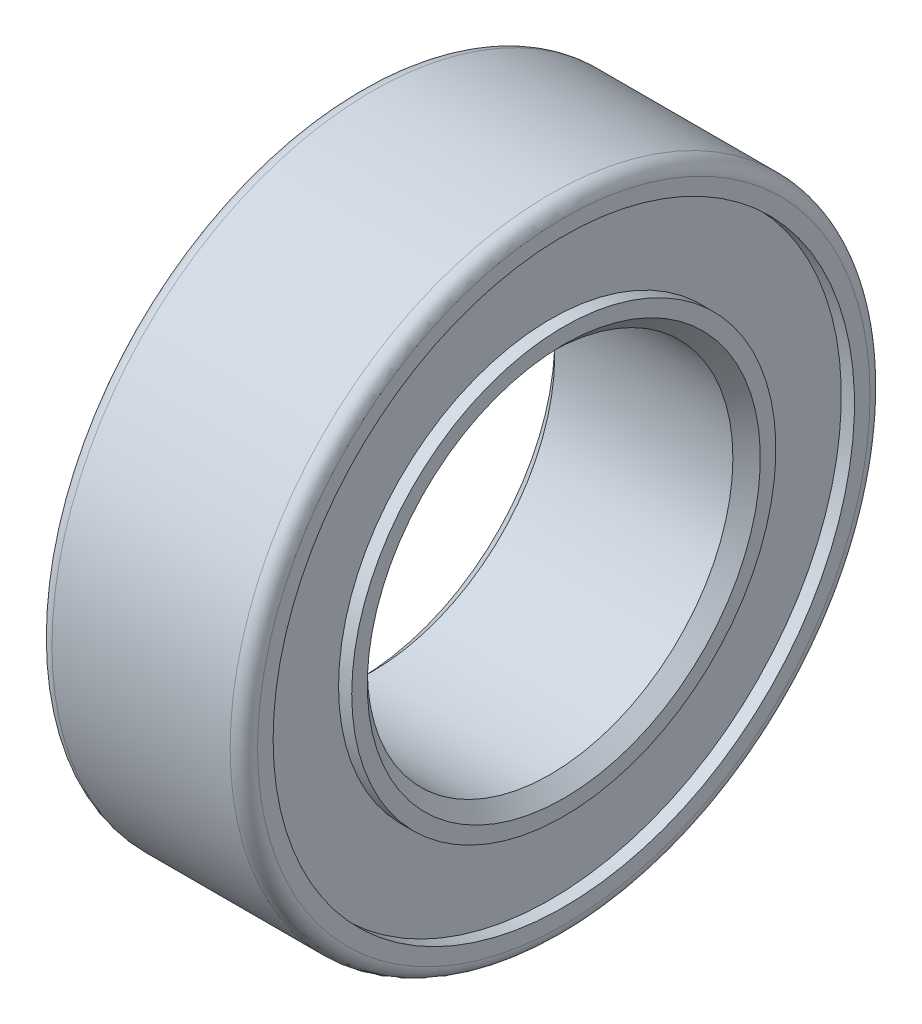
ISO-10303-21;
HEADER;
FILE_DESCRIPTION(('STEP AP214'),'2;1');
FILE_NAME('part.step','',(''),(''),'','','');
FILE_SCHEMA(('AUTOMOTIVE_DESIGN { 1 0 10303 214 1 1 1 1 }'));
ENDSEC;
DATA;
#1=APPLICATION_CONTEXT('core data for automotive mechanical design processes');
#2=APPLICATION_PROTOCOL_DEFINITION('international standard','automotive_design',2000,#1);
#3=PRODUCT_CONTEXT('',#1,'mechanical');
#4=PRODUCT('Part','Part','',(#3));
#5=PRODUCT_RELATED_PRODUCT_CATEGORY('part','',(#4));
#6=PRODUCT_DEFINITION_FORMATION('','',#4);
#7=PRODUCT_DEFINITION_CONTEXT('part definition',#1,'design');
#8=PRODUCT_DEFINITION('design','',#6,#7);
#9=PRODUCT_DEFINITION_SHAPE('','',#8);
#10=(LENGTH_UNIT() NAMED_UNIT(*) SI_UNIT(.MILLI.,.METRE.));
#11=(NAMED_UNIT(*) PLANE_ANGLE_UNIT() SI_UNIT($,.RADIAN.));
#12=(NAMED_UNIT(*) SI_UNIT($,.STERADIAN.) SOLID_ANGLE_UNIT());
#13=UNCERTAINTY_MEASURE_WITH_UNIT(LENGTH_MEASURE(1.E-05),#10,'distance_accuracy_value','');
#14=(GEOMETRIC_REPRESENTATION_CONTEXT(3) GLOBAL_UNCERTAINTY_ASSIGNED_CONTEXT((#13)) GLOBAL_UNIT_ASSIGNED_CONTEXT((#10,
#11,#12)) REPRESENTATION_CONTEXT('',''));
#15=CARTESIAN_POINT('',(0.,0.,0.));
#16=DIRECTION('',(0.,0.,1.));
#17=DIRECTION('',(1.,0.,0.));
#18=AXIS2_PLACEMENT_3D('',#15,#16,#17);
#19=CARTESIAN_POINT('',(0.,0.,0.));
#20=DIRECTION('',(-1.,0.,0.));
#21=DIRECTION('',(0.,0.,1.));
#22=AXIS2_PLACEMENT_3D('',#19,#20,#21);
#23=CYLINDRICAL_SURFACE('',#22,6.35);
#24=CARTESIAN_POINT('',(3.09397400002354,0.,0.));
#25=DIRECTION('',(1.,0.,0.));
#26=DIRECTION('',(0.,0.,-1.));
#27=AXIS2_PLACEMENT_3D('',#24,#25,#26);
#28=CIRCLE('',#27,6.34999999994079);
#29=CARTESIAN_POINT('',(3.09397400002354,0.,-6.34999999994079));
#30=VERTEX_POINT('',#29);
#31=EDGE_CURVE('E279',#30,#30,#28,.T.);
#32=ORIENTED_EDGE('',*,*,#31,.T.);
#33=EDGE_LOOP('',(#32));
#34=FACE_BOUND('',#33,.T.);
#35=CARTESIAN_POINT('',(-3.09397399996669,0.,0.));
#36=DIRECTION('',(-1.,0.,0.));
#37=DIRECTION('',(0.,0.,1.));
#38=AXIS2_PLACEMENT_3D('',#35,#36,#37);
#39=CIRCLE('',#38,6.35000000005448);
#40=CARTESIAN_POINT('',(-3.09397399996669,0.,6.35000000005448));
#41=VERTEX_POINT('',#40);
#42=EDGE_CURVE('E65',#41,#41,#39,.T.);
#43=ORIENTED_EDGE('',*,*,#42,.T.);
#44=EDGE_LOOP('',(#43));
#45=FACE_BOUND('',#44,.T.);
#46=ADVANCED_FACE('F17',(#34,#45),#23,.F.);
#47=CARTESIAN_POINT('',(3.57022399998641,0.,0.));
#48=DIRECTION('',(1.,0.,0.));
#49=DIRECTION('',(0.,1.,0.));
#50=AXIS2_PLACEMENT_3D('',#47,#48,#49);
#51=CONICAL_SURFACE('',#50,6.82624999990367,0.785398163397448);
#52=CARTESIAN_POINT('',(3.5702240001001,0.,0.));
#53=DIRECTION('',(1.,0.,0.));
#54=DIRECTION('',(0.,1.,0.));
#55=AXIS2_PLACEMENT_3D('',#52,#53,#54);
#56=CIRCLE('',#55,6.82625000001735);
#57=CARTESIAN_POINT('',(3.5702240001001,6.82625000001735,0.));
#58=VERTEX_POINT('',#57);
#59=EDGE_CURVE('E282',#58,#58,#56,.T.);
#60=ORIENTED_EDGE('',*,*,#59,.T.);
#61=EDGE_LOOP('',(#60));
#62=FACE_BOUND('',#61,.T.);
#63=ORIENTED_EDGE('',*,*,#31,.F.);
#64=EDGE_LOOP('',(#63));
#65=FACE_BOUND('',#64,.T.);
#66=ADVANCED_FACE('F218',(#62,#65),#51,.F.);
#67=CARTESIAN_POINT('',(-3.57022399998641,0.,0.));
#68=DIRECTION('',(-1.,0.,0.));
#69=DIRECTION('',(0.,-1.,0.));
#70=AXIS2_PLACEMENT_3D('',#67,#68,#69);
#71=CONICAL_SURFACE('',#70,6.82625000001735,0.78539816333777);
#72=ORIENTED_EDGE('',*,*,#42,.F.);
#73=EDGE_LOOP('',(#72));
#74=FACE_BOUND('',#73,.T.);
#75=CARTESIAN_POINT('',(-3.57022399998641,0.,0.));
#76=DIRECTION('',(-1.,0.,0.));
#77=DIRECTION('',(0.,-1.,0.));
#78=AXIS2_PLACEMENT_3D('',#75,#76,#77);
#79=CIRCLE('',#78,6.82625000001735);
#80=CARTESIAN_POINT('',(-3.57022399998641,-6.82625000001735,0.));
#81=VERTEX_POINT('',#80);
#82=EDGE_CURVE('E284',#81,#81,#79,.T.);
#83=ORIENTED_EDGE('',*,*,#82,.T.);
#84=EDGE_LOOP('',(#83));
#85=FACE_BOUND('',#84,.T.);
#86=ADVANCED_FACE('F210',(#74,#85),#71,.F.);
#87=CARTESIAN_POINT('',(3.570224,7.366,0.));
#88=DIRECTION('',(-1.,0.,0.));
#89=DIRECTION('',(0.,0.,1.));
#90=AXIS2_PLACEMENT_3D('',#87,#88,#89);
#91=PLANE('',#90);
#92=ORIENTED_EDGE('',*,*,#59,.F.);
#93=EDGE_LOOP('',(#92));
#94=FACE_BOUND('',#93,.T.);
#95=CARTESIAN_POINT('',(3.570224,0.,0.));
#96=DIRECTION('',(-1.,0.,0.));
#97=DIRECTION('',(0.,0.,1.));
#98=AXIS2_PLACEMENT_3D('',#95,#96,#97);
#99=CIRCLE('',#98,7.366);
#100=CARTESIAN_POINT('',(3.570224,0.,7.366));
#101=VERTEX_POINT('',#100);
#102=EDGE_CURVE('E307',#101,#101,#99,.T.);
#103=ORIENTED_EDGE('',*,*,#102,.F.);
#104=EDGE_LOOP('',(#103));
#105=FACE_BOUND('',#104,.T.);
#106=ADVANCED_FACE('F202',(#94,#105),#91,.F.);
#107=CARTESIAN_POINT('',(-3.570224,7.366,0.));
#108=DIRECTION('',(1.,0.,0.));
#109=DIRECTION('',(0.,0.,-1.));
#110=AXIS2_PLACEMENT_3D('',#107,#108,#109);
#111=PLANE('',#110);
#112=CARTESIAN_POINT('',(-3.570224,0.,0.));
#113=DIRECTION('',(-1.,0.,0.));
#114=DIRECTION('',(0.,0.,1.));
#115=AXIS2_PLACEMENT_3D('',#112,#113,#114);
#116=CIRCLE('',#115,7.366);
#117=CARTESIAN_POINT('',(-3.570224,0.,7.366));
#118=VERTEX_POINT('',#117);
#119=EDGE_CURVE('E304',#118,#118,#116,.F.);
#120=ORIENTED_EDGE('',*,*,#119,.F.);
#121=EDGE_LOOP('',(#120));
#122=FACE_BOUND('',#121,.T.);
#123=ORIENTED_EDGE('',*,*,#82,.F.);
#124=EDGE_LOOP('',(#123));
#125=FACE_BOUND('',#124,.T.);
#126=ADVANCED_FACE('F194',(#122,#125),#111,.F.);
#127=CARTESIAN_POINT('',(0.,0.,0.));
#128=DIRECTION('',(-1.,0.,0.));
#129=DIRECTION('',(0.,0.,1.));
#130=AXIS2_PLACEMENT_3D('',#127,#128,#129);
#131=CYLINDRICAL_SURFACE('',#130,7.366);
#132=CARTESIAN_POINT('',(3.113024,0.,0.));
#133=DIRECTION('',(-1.,0.,0.));
#134=DIRECTION('',(0.,0.,1.));
#135=AXIS2_PLACEMENT_3D('',#132,#133,#134);
#136=CIRCLE('',#135,7.366);
#137=CARTESIAN_POINT('',(3.113024,0.,7.366));
#138=VERTEX_POINT('',#137);
#139=EDGE_CURVE('E301',#138,#138,#136,.F.);
#140=ORIENTED_EDGE('',*,*,#139,.T.);
#141=EDGE_LOOP('',(#140));
#142=FACE_BOUND('',#141,.T.);
#143=ORIENTED_EDGE('',*,*,#102,.T.);
#144=EDGE_LOOP('',(#143));
#145=FACE_BOUND('',#144,.T.);
#146=ADVANCED_FACE('F186',(#142,#145),#131,.T.);
#147=CARTESIAN_POINT('',(0.,0.,0.));
#148=DIRECTION('',(-1.,0.,0.));
#149=DIRECTION('',(0.,0.,1.));
#150=AXIS2_PLACEMENT_3D('',#147,#148,#149);
#151=CYLINDRICAL_SURFACE('',#150,7.366);
#152=ORIENTED_EDGE('',*,*,#119,.T.);
#153=EDGE_LOOP('',(#152));
#154=FACE_BOUND('',#153,.T.);
#155=CARTESIAN_POINT('',(-3.113024,0.,0.));
#156=DIRECTION('',(-1.,0.,0.));
#157=DIRECTION('',(0.,0.,1.));
#158=AXIS2_PLACEMENT_3D('',#155,#156,#157);
#159=CIRCLE('',#158,7.366);
#160=CARTESIAN_POINT('',(-3.113024,0.,7.366));
#161=VERTEX_POINT('',#160);
#162=EDGE_CURVE('E298',#161,#161,#159,.T.);
#163=ORIENTED_EDGE('',*,*,#162,.T.);
#164=EDGE_LOOP('',(#163));
#165=FACE_BOUND('',#164,.T.);
#166=ADVANCED_FACE('F178',(#154,#165),#151,.T.);
#167=CARTESIAN_POINT('',(3.113024,10.0965,0.));
#168=DIRECTION('',(-1.,0.,0.));
#169=DIRECTION('',(0.,0.,1.));
#170=AXIS2_PLACEMENT_3D('',#167,#168,#169);
#171=PLANE('',#170);
#172=ORIENTED_EDGE('',*,*,#139,.F.);
#173=EDGE_LOOP('',(#172));
#174=FACE_BOUND('',#173,.T.);
#175=CARTESIAN_POINT('',(3.113024,0.,0.));
#176=DIRECTION('',(-1.,0.,0.));
#177=DIRECTION('',(0.,0.,1.));
#178=AXIS2_PLACEMENT_3D('',#175,#176,#177);
#179=CIRCLE('',#178,10.0965);
#180=CARTESIAN_POINT('',(3.113024,0.,10.0965));
#181=VERTEX_POINT('',#180);
#182=EDGE_CURVE('E295',#181,#181,#179,.F.);
#183=ORIENTED_EDGE('',*,*,#182,.T.);
#184=EDGE_LOOP('',(#183));
#185=FACE_BOUND('',#184,.T.);
#186=ADVANCED_FACE('F170',(#174,#185),#171,.F.);
#187=CARTESIAN_POINT('',(-3.113024,7.366,0.));
#188=DIRECTION('',(1.,0.,0.));
#189=DIRECTION('',(0.,0.,-1.));
#190=AXIS2_PLACEMENT_3D('',#187,#188,#189);
#191=PLANE('',#190);
#192=CARTESIAN_POINT('',(-3.113024,0.,0.));
#193=DIRECTION('',(-1.,0.,0.));
#194=DIRECTION('',(0.,0.,1.));
#195=AXIS2_PLACEMENT_3D('',#192,#193,#194);
#196=CIRCLE('',#195,10.0965);
#197=CARTESIAN_POINT('',(-3.113024,0.,10.0965));
#198=VERTEX_POINT('',#197);
#199=EDGE_CURVE('E292',#198,#198,#196,.T.);
#200=ORIENTED_EDGE('',*,*,#199,.T.);
#201=EDGE_LOOP('',(#200));
#202=FACE_BOUND('',#201,.T.);
#203=ORIENTED_EDGE('',*,*,#162,.F.);
#204=EDGE_LOOP('',(#203));
#205=FACE_BOUND('',#204,.T.);
#206=ADVANCED_FACE('F162',(#202,#205),#191,.F.);
#207=CARTESIAN_POINT('',(0.,0.,0.));
#208=DIRECTION('',(-1.,0.,0.));
#209=DIRECTION('',(0.,0.,1.));
#210=AXIS2_PLACEMENT_3D('',#207,#208,#209);
#211=CYLINDRICAL_SURFACE('',#210,10.0965);
#212=CARTESIAN_POINT('',(3.570224,0.,0.));
#213=DIRECTION('',(-1.,0.,0.));
#214=DIRECTION('',(0.,0.,1.));
#215=AXIS2_PLACEMENT_3D('',#212,#213,#214);
#216=CIRCLE('',#215,10.0965);
#217=CARTESIAN_POINT('',(3.570224,0.,10.0965));
#218=VERTEX_POINT('',#217);
#219=EDGE_CURVE('E289',#218,#218,#216,.F.);
#220=ORIENTED_EDGE('',*,*,#219,.T.);
#221=EDGE_LOOP('',(#220));
#222=FACE_BOUND('',#221,.T.);
#223=ORIENTED_EDGE('',*,*,#182,.F.);
#224=EDGE_LOOP('',(#223));
#225=FACE_BOUND('',#224,.T.);
#226=ADVANCED_FACE('F154',(#222,#225),#211,.F.);
#227=CARTESIAN_POINT('',(0.,0.,0.));
#228=DIRECTION('',(-1.,0.,0.));
#229=DIRECTION('',(0.,0.,1.));
#230=AXIS2_PLACEMENT_3D('',#227,#228,#229);
#231=CYLINDRICAL_SURFACE('',#230,10.0965);
#232=ORIENTED_EDGE('',*,*,#199,.F.);
#233=EDGE_LOOP('',(#232));
#234=FACE_BOUND('',#233,.T.);
#235=CARTESIAN_POINT('',(-3.570224,0.,0.));
#236=DIRECTION('',(-1.,0.,0.));
#237=DIRECTION('',(0.,0.,1.));
#238=AXIS2_PLACEMENT_3D('',#235,#236,#237);
#239=CIRCLE('',#238,10.0965);
#240=CARTESIAN_POINT('',(-3.570224,0.,10.0965));
#241=VERTEX_POINT('',#240);
#242=EDGE_CURVE('E52',#241,#241,#239,.T.);
#243=ORIENTED_EDGE('',*,*,#242,.T.);
#244=EDGE_LOOP('',(#243));
#245=FACE_BOUND('',#244,.T.);
#246=ADVANCED_FACE('F147',(#234,#245),#231,.F.);
#247=CARTESIAN_POINT('',(3.570224,10.63625,0.));
#248=DIRECTION('',(-1.,0.,0.));
#249=DIRECTION('',(0.,0.,1.));
#250=AXIS2_PLACEMENT_3D('',#247,#248,#249);
#251=PLANE('',#250);
#252=ORIENTED_EDGE('',*,*,#219,.F.);
#253=EDGE_LOOP('',(#252));
#254=FACE_BOUND('',#253,.T.);
#255=CARTESIAN_POINT('',(3.570224,0.,0.));
#256=DIRECTION('',(-1.,0.,0.));
#257=DIRECTION('',(0.,0.,-1.));
#258=AXIS2_PLACEMENT_3D('',#255,#256,#257);
#259=CIRCLE('',#258,10.63625);
#260=CARTESIAN_POINT('',(3.570224,0.,-10.63625));
#261=VERTEX_POINT('',#260);
#262=CARTESIAN_POINT('',(3.570224,0.,10.63625));
#263=VERTEX_POINT('',#262);
#264=EDGE_CURVE('E48',#261,#263,#259,.T.);
#265=ORIENTED_EDGE('',*,*,#264,.F.);
#266=CARTESIAN_POINT('',(3.570224,0.,0.));
#267=DIRECTION('',(-1.,0.,0.));
#268=DIRECTION('',(0.,0.,1.));
#269=AXIS2_PLACEMENT_3D('',#266,#267,#268);
#270=CIRCLE('',#269,10.63625);
#271=EDGE_CURVE('E45',#263,#261,#270,.T.);
#272=ORIENTED_EDGE('',*,*,#271,.F.);
#273=EDGE_LOOP('',(#265,#272));
#274=FACE_BOUND('',#273,.T.);
#275=ADVANCED_FACE('F50',(#254,#274),#251,.F.);
#276=CARTESIAN_POINT('',(-3.570224,10.63625,0.));
#277=DIRECTION('',(1.,0.,0.));
#278=DIRECTION('',(0.,0.,-1.));
#279=AXIS2_PLACEMENT_3D('',#276,#277,#278);
#280=PLANE('',#279);
#281=CARTESIAN_POINT('',(-3.570224,0.,0.));
#282=DIRECTION('',(1.,0.,0.));
#283=DIRECTION('',(0.,0.,1.));
#284=AXIS2_PLACEMENT_3D('',#281,#282,#283);
#285=CIRCLE('',#284,10.63625);
#286=CARTESIAN_POINT('',(-3.570224,0.,10.63625));
#287=VERTEX_POINT('',#286);
#288=CARTESIAN_POINT('',(-3.570224,0.,-10.63625));
#289=VERTEX_POINT('',#288);
#290=EDGE_CURVE('E36',#287,#289,#285,.T.);
#291=ORIENTED_EDGE('',*,*,#290,.F.);
#292=CARTESIAN_POINT('',(-3.570224,0.,0.));
#293=DIRECTION('',(1.,0.,0.));
#294=DIRECTION('',(0.,0.,-1.));
#295=AXIS2_PLACEMENT_3D('',#292,#293,#294);
#296=CIRCLE('',#295,10.63625);
#297=EDGE_CURVE('E56',#289,#287,#296,.T.);
#298=ORIENTED_EDGE('',*,*,#297,.F.);
#299=EDGE_LOOP('',(#291,#298));
#300=FACE_BOUND('',#299,.T.);
#301=ORIENTED_EDGE('',*,*,#242,.F.);
#302=EDGE_LOOP('',(#301));
#303=FACE_BOUND('',#302,.T.);
#304=ADVANCED_FACE('F78',(#300,#303),#280,.F.);
#305=CARTESIAN_POINT('',(3.093974,0.,0.));
#306=DIRECTION('',(-1.,0.,0.));
#307=DIRECTION('',(0.,0.,1.));
#308=AXIS2_PLACEMENT_3D('',#305,#306,#307);
#309=TOROIDAL_SURFACE('',#308,10.63625,0.476249999999999);
#310=CARTESIAN_POINT('',(3.09397399999999,0.,0.));
#311=DIRECTION('',(-1.,0.,0.));
#312=DIRECTION('',(0.,0.,1.));
#313=AXIS2_PLACEMENT_3D('',#310,#311,#312);
#314=CIRCLE('',#313,11.1125);
#315=CARTESIAN_POINT('',(3.09397399999999,0.,11.1125));
#316=VERTEX_POINT('',#315);
#317=EDGE_CURVE('E28',#316,#316,#314,.T.);
#318=ORIENTED_EDGE('',*,*,#317,.F.);
#319=EDGE_LOOP('',(#318));
#320=FACE_BOUND('',#319,.T.);
#321=ORIENTED_EDGE('',*,*,#271,.T.);
#322=ORIENTED_EDGE('',*,*,#264,.T.);
#323=EDGE_LOOP('',(#321,#322));
#324=FACE_BOUND('',#323,.T.);
#325=ADVANCED_FACE('F55',(#320,#324),#309,.T.);
#326=CARTESIAN_POINT('',(-3.093974,0.,0.));
#327=DIRECTION('',(-1.,0.,0.));
#328=DIRECTION('',(0.,0.,1.));
#329=AXIS2_PLACEMENT_3D('',#326,#327,#328);
#330=TOROIDAL_SURFACE('',#329,10.63625,0.47625);
#331=ORIENTED_EDGE('',*,*,#290,.T.);
#332=ORIENTED_EDGE('',*,*,#297,.T.);
#333=EDGE_LOOP('',(#331,#332));
#334=FACE_BOUND('',#333,.T.);
#335=CARTESIAN_POINT('',(-3.093974,0.,0.));
#336=DIRECTION('',(-1.,0.,0.));
#337=DIRECTION('',(0.,0.,1.));
#338=AXIS2_PLACEMENT_3D('',#335,#336,#337);
#339=CIRCLE('',#338,11.1125);
#340=CARTESIAN_POINT('',(-3.093974,0.,11.1125));
#341=VERTEX_POINT('',#340);
#342=EDGE_CURVE('E10',#341,#341,#339,.F.);
#343=ORIENTED_EDGE('',*,*,#342,.F.);
#344=EDGE_LOOP('',(#343));
#345=FACE_BOUND('',#344,.T.);
#346=ADVANCED_FACE('F77',(#334,#345),#330,.T.);
#347=CARTESIAN_POINT('',(0.,0.,0.));
#348=DIRECTION('',(-1.,0.,0.));
#349=DIRECTION('',(0.,0.,1.));
#350=AXIS2_PLACEMENT_3D('',#347,#348,#349);
#351=CYLINDRICAL_SURFACE('',#350,11.1125);
#352=ORIENTED_EDGE('',*,*,#342,.T.);
#353=EDGE_LOOP('',(#352));
#354=FACE_BOUND('',#353,.T.);
#355=ORIENTED_EDGE('',*,*,#317,.T.);
#356=EDGE_LOOP('',(#355));
#357=FACE_BOUND('',#356,.T.);
#358=ADVANCED_FACE('F120',(#354,#357),#351,.T.);
#359=CLOSED_SHELL('',(#46,#66,#86,#106,#126,#146,#166,#186,#206,#226,#246,#275,#304,#325,#346,#358));
#360=MANIFOLD_SOLID_BREP('B1',#359);
#361=ADVANCED_BREP_SHAPE_REPRESENTATION('',(#18,#360),#14);
#362=SHAPE_DEFINITION_REPRESENTATION(#9,#361);
ENDSEC;
END-ISO-10303-21;
